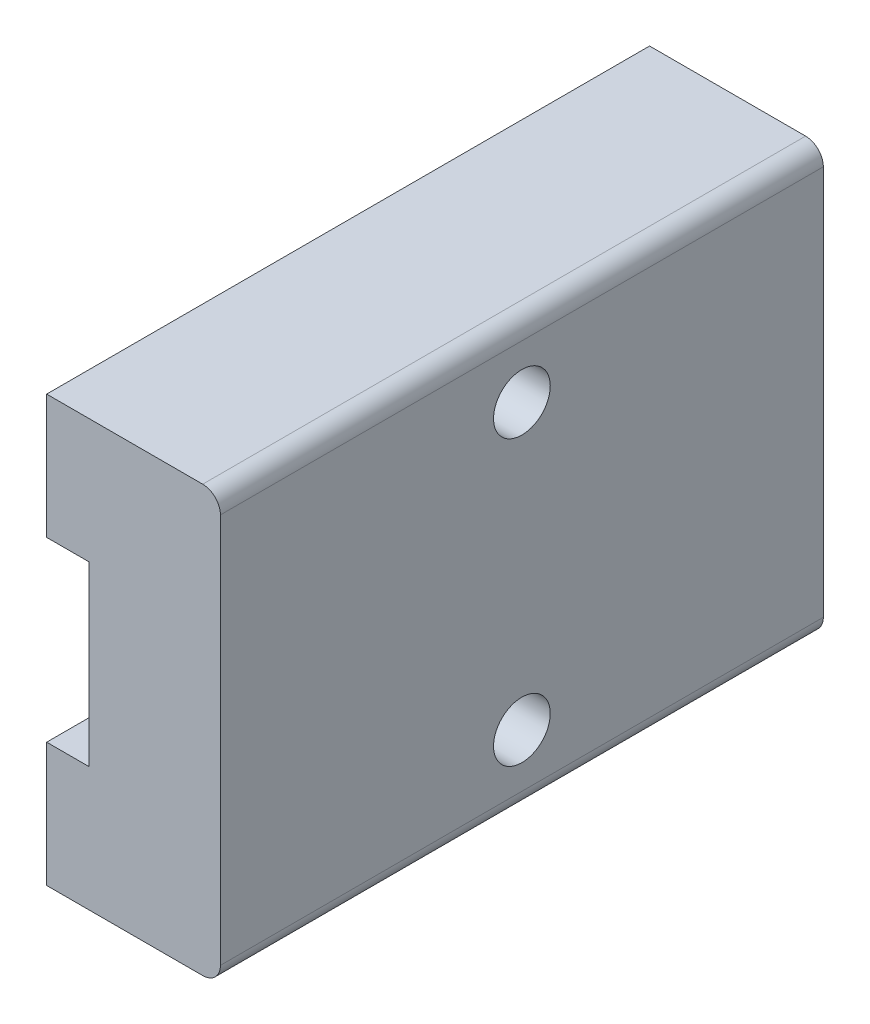
ISO-10303-21;
HEADER;
FILE_DESCRIPTION(('STEP AP214'),'2;1');
FILE_NAME('part.step','',(''),(''),'','','');
FILE_SCHEMA(('AUTOMOTIVE_DESIGN { 1 0 10303 214 1 1 1 1 }'));
ENDSEC;
DATA;
#1=APPLICATION_CONTEXT('core data for automotive mechanical design processes');
#2=APPLICATION_PROTOCOL_DEFINITION('international standard','automotive_design',2000,#1);
#3=PRODUCT_CONTEXT('',#1,'mechanical');
#4=PRODUCT('Part','Part','',(#3));
#5=PRODUCT_RELATED_PRODUCT_CATEGORY('part','',(#4));
#6=PRODUCT_DEFINITION_FORMATION('','',#4);
#7=PRODUCT_DEFINITION_CONTEXT('part definition',#1,'design');
#8=PRODUCT_DEFINITION('design','',#6,#7);
#9=PRODUCT_DEFINITION_SHAPE('','',#8);
#10=(LENGTH_UNIT() NAMED_UNIT(*) SI_UNIT(.MILLI.,.METRE.));
#11=(NAMED_UNIT(*) PLANE_ANGLE_UNIT() SI_UNIT($,.RADIAN.));
#12=(NAMED_UNIT(*) SI_UNIT($,.STERADIAN.) SOLID_ANGLE_UNIT());
#13=UNCERTAINTY_MEASURE_WITH_UNIT(LENGTH_MEASURE(1.E-05),#10,'distance_accuracy_value','');
#14=(GEOMETRIC_REPRESENTATION_CONTEXT(3) GLOBAL_UNCERTAINTY_ASSIGNED_CONTEXT((#13)) GLOBAL_UNIT_ASSIGNED_CONTEXT((#10,
#11,#12)) REPRESENTATION_CONTEXT('',''));
#15=CARTESIAN_POINT('',(0.,0.,0.));
#16=DIRECTION('',(0.,0.,1.));
#17=DIRECTION('',(1.,0.,0.));
#18=AXIS2_PLACEMENT_3D('',#15,#16,#17);
#19=CARTESIAN_POINT('',(-2.45,-6.,17.));
#20=DIRECTION('',(1.,0.,0.));
#21=DIRECTION('',(0.,0.,-1.));
#22=AXIS2_PLACEMENT_3D('',#19,#20,#21);
#23=PLANE('',#22);
#24=DIRECTION('',(0.,-1.,0.));
#25=VECTOR('',#24,1.);
#26=CARTESIAN_POINT('',(-2.45,-6.,0.));
#27=LINE('',#26,#25);
#28=CARTESIAN_POINT('',(-2.45,6.,0.));
#29=VERTEX_POINT('',#28);
#30=CARTESIAN_POINT('',(-2.45,2.5,0.));
#31=VERTEX_POINT('',#30);
#32=EDGE_CURVE('E203',#29,#31,#27,.T.);
#33=ORIENTED_EDGE('',*,*,#32,.T.);
#34=DIRECTION('',(0.,0.,1.));
#35=VECTOR('',#34,1.);
#36=CARTESIAN_POINT('',(-2.45,2.5,0.));
#37=LINE('',#36,#35);
#38=CARTESIAN_POINT('',(-2.45,2.5,17.));
#39=VERTEX_POINT('',#38);
#40=EDGE_CURVE('E175',#31,#39,#37,.T.);
#41=ORIENTED_EDGE('',*,*,#40,.T.);
#42=DIRECTION('',(0.,-1.,0.));
#43=VECTOR('',#42,1.);
#44=CARTESIAN_POINT('',(-2.45,-6.,17.));
#45=LINE('',#44,#43);
#46=CARTESIAN_POINT('',(-2.45,6.,17.));
#47=VERTEX_POINT('',#46);
#48=EDGE_CURVE('E188',#47,#39,#45,.T.);
#49=ORIENTED_EDGE('',*,*,#48,.F.);
#50=DIRECTION('',(0.,0.,-1.));
#51=VECTOR('',#50,1.);
#52=CARTESIAN_POINT('',(-2.45,6.,17.));
#53=LINE('',#52,#51);
#54=EDGE_CURVE('E202',#47,#29,#53,.T.);
#55=ORIENTED_EDGE('',*,*,#54,.T.);
#56=EDGE_LOOP('',(#33,#41,#49,#55));
#57=FACE_BOUND('',#56,.T.);
#58=ADVANCED_FACE('F42',(#57),#23,.F.);
#59=CARTESIAN_POINT('',(-2.45,-2.5,17.));
#60=VERTEX_POINT('',#59);
#61=CARTESIAN_POINT('',(-2.45,-6.,17.));
#62=VERTEX_POINT('',#61);
#63=EDGE_CURVE('E193',#60,#62,#45,.T.);
#64=ORIENTED_EDGE('',*,*,#63,.F.);
#65=DIRECTION('',(0.,0.,1.));
#66=VECTOR('',#65,1.);
#67=CARTESIAN_POINT('',(-2.45,-2.5,0.));
#68=LINE('',#67,#66);
#69=CARTESIAN_POINT('',(-2.45,-2.5,0.));
#70=VERTEX_POINT('',#69);
#71=EDGE_CURVE('E165',#70,#60,#68,.T.);
#72=ORIENTED_EDGE('',*,*,#71,.F.);
#73=CARTESIAN_POINT('',(-2.45,-6.,0.));
#74=VERTEX_POINT('',#73);
#75=EDGE_CURVE('E179',#70,#74,#27,.T.);
#76=ORIENTED_EDGE('',*,*,#75,.T.);
#77=DIRECTION('',(0.,0.,-1.));
#78=VECTOR('',#77,1.);
#79=CARTESIAN_POINT('',(-2.45,-6.,17.));
#80=LINE('',#79,#78);
#81=EDGE_CURVE('E219',#62,#74,#80,.T.);
#82=ORIENTED_EDGE('',*,*,#81,.F.);
#83=EDGE_LOOP('',(#64,#72,#76,#82));
#84=FACE_BOUND('',#83,.T.);
#85=ADVANCED_FACE('F268',(#84),#23,.F.);
#86=CARTESIAN_POINT('',(2.45,-6.,17.));
#87=DIRECTION('',(0.,1.,0.));
#88=DIRECTION('',(0.,0.,1.));
#89=AXIS2_PLACEMENT_3D('',#86,#87,#88);
#90=PLANE('',#89);
#91=DIRECTION('',(1.,0.,0.));
#92=VECTOR('',#91,1.);
#93=CARTESIAN_POINT('',(2.45,-6.,0.));
#94=LINE('',#93,#92);
#95=CARTESIAN_POINT('',(1.95,-6.,0.));
#96=VERTEX_POINT('',#95);
#97=EDGE_CURVE('E207',#74,#96,#94,.T.);
#98=ORIENTED_EDGE('',*,*,#97,.T.);
#99=DIRECTION('',(0.,0.,-1.));
#100=VECTOR('',#99,1.);
#101=CARTESIAN_POINT('',(1.95,-6.,17.));
#102=LINE('',#101,#100);
#103=CARTESIAN_POINT('',(1.95,-6.,17.));
#104=VERTEX_POINT('',#103);
#105=EDGE_CURVE('E11',#96,#104,#102,.F.);
#106=ORIENTED_EDGE('',*,*,#105,.T.);
#107=DIRECTION('',(1.,0.,0.));
#108=VECTOR('',#107,1.);
#109=CARTESIAN_POINT('',(2.45,-6.,17.));
#110=LINE('',#109,#108);
#111=EDGE_CURVE('E192',#62,#104,#110,.T.);
#112=ORIENTED_EDGE('',*,*,#111,.F.);
#113=ORIENTED_EDGE('',*,*,#81,.T.);
#114=EDGE_LOOP('',(#98,#106,#112,#113));
#115=FACE_BOUND('',#114,.T.);
#116=ADVANCED_FACE('F264',(#115),#90,.F.);
#117=CARTESIAN_POINT('',(2.45,-6.,17.));
#118=DIRECTION('',(-1.,0.,0.));
#119=DIRECTION('',(0.,0.,1.));
#120=AXIS2_PLACEMENT_3D('',#117,#118,#119);
#121=PLANE('',#120);
#122=CARTESIAN_POINT('',(2.45,4.,8.5));
#123=DIRECTION('',(1.,0.,0.));
#124=DIRECTION('',(0.,0.,-1.));
#125=AXIS2_PLACEMENT_3D('',#122,#123,#124);
#126=CIRCLE('',#125,0.799999999999999);
#127=CARTESIAN_POINT('',(2.45,4.,7.7));
#128=VERTEX_POINT('',#127);
#129=EDGE_CURVE('E138',#128,#128,#126,.T.);
#130=ORIENTED_EDGE('',*,*,#129,.F.);
#131=EDGE_LOOP('',(#130));
#132=FACE_BOUND('',#131,.T.);
#133=CARTESIAN_POINT('',(2.45,-4.,8.5));
#134=DIRECTION('',(1.,0.,0.));
#135=DIRECTION('',(0.,0.,-1.));
#136=AXIS2_PLACEMENT_3D('',#133,#134,#135);
#137=CIRCLE('',#136,0.799999999999999);
#138=CARTESIAN_POINT('',(2.45,-4.,7.7));
#139=VERTEX_POINT('',#138);
#140=EDGE_CURVE('E137',#139,#139,#137,.T.);
#141=ORIENTED_EDGE('',*,*,#140,.F.);
#142=EDGE_LOOP('',(#141));
#143=FACE_BOUND('',#142,.T.);
#144=DIRECTION('',(0.,1.,0.));
#145=VECTOR('',#144,1.);
#146=CARTESIAN_POINT('',(2.45,-6.,0.));
#147=LINE('',#146,#145);
#148=CARTESIAN_POINT('',(2.45,-5.5,0.));
#149=VERTEX_POINT('',#148);
#150=CARTESIAN_POINT('',(2.45,5.5,0.));
#151=VERTEX_POINT('',#150);
#152=EDGE_CURVE('E210',#149,#151,#147,.T.);
#153=ORIENTED_EDGE('',*,*,#152,.T.);
#154=DIRECTION('',(0.,0.,-1.));
#155=VECTOR('',#154,1.);
#156=CARTESIAN_POINT('',(2.45,5.5,17.));
#157=LINE('',#156,#155);
#158=CARTESIAN_POINT('',(2.45,5.5,17.));
#159=VERTEX_POINT('',#158);
#160=EDGE_CURVE('E64',#151,#159,#157,.F.);
#161=ORIENTED_EDGE('',*,*,#160,.T.);
#162=DIRECTION('',(0.,1.,0.));
#163=VECTOR('',#162,1.);
#164=CARTESIAN_POINT('',(2.45,-6.,17.));
#165=LINE('',#164,#163);
#166=CARTESIAN_POINT('',(2.45,-5.5,17.));
#167=VERTEX_POINT('',#166);
#168=EDGE_CURVE('E196',#167,#159,#165,.T.);
#169=ORIENTED_EDGE('',*,*,#168,.F.);
#170=DIRECTION('',(0.,0.,-1.));
#171=VECTOR('',#170,1.);
#172=CARTESIAN_POINT('',(2.45,-5.5,17.));
#173=LINE('',#172,#171);
#174=EDGE_CURVE('E233',#167,#149,#173,.T.);
#175=ORIENTED_EDGE('',*,*,#174,.T.);
#176=EDGE_LOOP('',(#153,#161,#169,#175));
#177=FACE_BOUND('',#176,.T.);
#178=ADVANCED_FACE('F258',(#132,#143,#177),#121,.F.);
#179=CARTESIAN_POINT('',(2.45,6.,17.));
#180=DIRECTION('',(0.,-1.,0.));
#181=DIRECTION('',(1.,0.,0.));
#182=AXIS2_PLACEMENT_3D('',#179,#180,#181);
#183=PLANE('',#182);
#184=DIRECTION('',(-1.,0.,0.));
#185=VECTOR('',#184,1.);
#186=CARTESIAN_POINT('',(2.45,6.,17.));
#187=LINE('',#186,#185);
#188=CARTESIAN_POINT('',(1.95,6.,17.));
#189=VERTEX_POINT('',#188);
#190=EDGE_CURVE('E199',#189,#47,#187,.T.);
#191=ORIENTED_EDGE('',*,*,#190,.F.);
#192=DIRECTION('',(0.,0.,-1.));
#193=VECTOR('',#192,1.);
#194=CARTESIAN_POINT('',(1.95,6.,17.));
#195=LINE('',#194,#193);
#196=CARTESIAN_POINT('',(1.95,6.,0.));
#197=VERTEX_POINT('',#196);
#198=EDGE_CURVE('E223',#189,#197,#195,.T.);
#199=ORIENTED_EDGE('',*,*,#198,.T.);
#200=DIRECTION('',(-1.,0.,0.));
#201=VECTOR('',#200,1.);
#202=CARTESIAN_POINT('',(2.45,6.,0.));
#203=LINE('',#202,#201);
#204=EDGE_CURVE('E213',#197,#29,#203,.T.);
#205=ORIENTED_EDGE('',*,*,#204,.T.);
#206=ORIENTED_EDGE('',*,*,#54,.F.);
#207=EDGE_LOOP('',(#191,#199,#205,#206));
#208=FACE_BOUND('',#207,.T.);
#209=ADVANCED_FACE('F250',(#208),#183,.F.);
#210=CARTESIAN_POINT('',(0.,0.,17.));
#211=DIRECTION('',(0.,0.,1.));
#212=DIRECTION('',(1.,0.,0.));
#213=AXIS2_PLACEMENT_3D('',#210,#211,#212);
#214=PLANE('',#213);
#215=ORIENTED_EDGE('',*,*,#168,.T.);
#216=CARTESIAN_POINT('',(1.95,5.5,17.));
#217=DIRECTION('',(0.,0.,1.));
#218=DIRECTION('',(1.,0.,0.));
#219=AXIS2_PLACEMENT_3D('',#216,#217,#218);
#220=CIRCLE('',#219,0.5);
#221=EDGE_CURVE('E51',#159,#189,#220,.T.);
#222=ORIENTED_EDGE('',*,*,#221,.T.);
#223=ORIENTED_EDGE('',*,*,#190,.T.);
#224=ORIENTED_EDGE('',*,*,#48,.T.);
#225=DIRECTION('',(-1.,0.,0.));
#226=VECTOR('',#225,1.);
#227=CARTESIAN_POINT('',(-1.25,2.5,17.));
#228=LINE('',#227,#226);
#229=CARTESIAN_POINT('',(-1.25,2.5,17.));
#230=VERTEX_POINT('',#229);
#231=EDGE_CURVE('E157',#230,#39,#228,.T.);
#232=ORIENTED_EDGE('',*,*,#231,.F.);
#233=DIRECTION('',(0.,1.,0.));
#234=VECTOR('',#233,1.);
#235=CARTESIAN_POINT('',(-1.25,-2.5,17.));
#236=LINE('',#235,#234);
#237=CARTESIAN_POINT('',(-1.25,-2.5,17.));
#238=VERTEX_POINT('',#237);
#239=EDGE_CURVE('E169',#238,#230,#236,.T.);
#240=ORIENTED_EDGE('',*,*,#239,.F.);
#241=DIRECTION('',(1.,0.,0.));
#242=VECTOR('',#241,1.);
#243=CARTESIAN_POINT('',(-2.45,-2.5,17.));
#244=LINE('',#243,#242);
#245=EDGE_CURVE('E151',#60,#238,#244,.T.);
#246=ORIENTED_EDGE('',*,*,#245,.F.);
#247=ORIENTED_EDGE('',*,*,#63,.T.);
#248=ORIENTED_EDGE('',*,*,#111,.T.);
#249=CARTESIAN_POINT('',(1.95,-5.5,17.));
#250=DIRECTION('',(0.,0.,1.));
#251=DIRECTION('',(1.,0.,0.));
#252=AXIS2_PLACEMENT_3D('',#249,#250,#251);
#253=CIRCLE('',#252,0.5);
#254=EDGE_CURVE('E239',#104,#167,#253,.T.);
#255=ORIENTED_EDGE('',*,*,#254,.T.);
#256=EDGE_LOOP('',(#215,#222,#223,#224,#232,#240,#246,#247,#248,#255));
#257=FACE_BOUND('',#256,.T.);
#258=ADVANCED_FACE('F245',(#257),#214,.T.);
#259=CARTESIAN_POINT('',(0.,0.,0.));
#260=DIRECTION('',(0.,0.,1.));
#261=DIRECTION('',(1.,0.,0.));
#262=AXIS2_PLACEMENT_3D('',#259,#260,#261);
#263=PLANE('',#262);
#264=ORIENTED_EDGE('',*,*,#204,.F.);
#265=CARTESIAN_POINT('',(1.95,5.5,0.));
#266=DIRECTION('',(0.,0.,1.));
#267=DIRECTION('',(1.,0.,0.));
#268=AXIS2_PLACEMENT_3D('',#265,#266,#267);
#269=CIRCLE('',#268,0.5);
#270=EDGE_CURVE('E230',#197,#151,#269,.F.);
#271=ORIENTED_EDGE('',*,*,#270,.T.);
#272=ORIENTED_EDGE('',*,*,#152,.F.);
#273=CARTESIAN_POINT('',(1.95,-5.5,0.));
#274=DIRECTION('',(0.,0.,1.));
#275=DIRECTION('',(1.,0.,0.));
#276=AXIS2_PLACEMENT_3D('',#273,#274,#275);
#277=CIRCLE('',#276,0.5);
#278=EDGE_CURVE('E227',#149,#96,#277,.F.);
#279=ORIENTED_EDGE('',*,*,#278,.T.);
#280=ORIENTED_EDGE('',*,*,#97,.F.);
#281=ORIENTED_EDGE('',*,*,#75,.F.);
#282=DIRECTION('',(1.,0.,0.));
#283=VECTOR('',#282,1.);
#284=CARTESIAN_POINT('',(-2.45,-2.5,0.));
#285=LINE('',#284,#283);
#286=CARTESIAN_POINT('',(-1.25,-2.5,0.));
#287=VERTEX_POINT('',#286);
#288=EDGE_CURVE('E152',#70,#287,#285,.T.);
#289=ORIENTED_EDGE('',*,*,#288,.T.);
#290=DIRECTION('',(0.,1.,0.));
#291=VECTOR('',#290,1.);
#292=CARTESIAN_POINT('',(-1.25,-2.5,0.));
#293=LINE('',#292,#291);
#294=CARTESIAN_POINT('',(-1.25,2.5,0.));
#295=VERTEX_POINT('',#294);
#296=EDGE_CURVE('E156',#287,#295,#293,.T.);
#297=ORIENTED_EDGE('',*,*,#296,.T.);
#298=DIRECTION('',(-1.,0.,0.));
#299=VECTOR('',#298,1.);
#300=CARTESIAN_POINT('',(-1.25,2.5,0.));
#301=LINE('',#300,#299);
#302=EDGE_CURVE('E161',#295,#31,#301,.T.);
#303=ORIENTED_EDGE('',*,*,#302,.T.);
#304=ORIENTED_EDGE('',*,*,#32,.F.);
#305=EDGE_LOOP('',(#264,#271,#272,#279,#280,#281,#289,#297,#303,#304));
#306=FACE_BOUND('',#305,.T.);
#307=ADVANCED_FACE('F256',(#306),#263,.F.);
#308=CARTESIAN_POINT('',(-1.25,2.5,0.));
#309=DIRECTION('',(0.,1.,0.));
#310=DIRECTION('',(0.,0.,1.));
#311=AXIS2_PLACEMENT_3D('',#308,#309,#310);
#312=PLANE('',#311);
#313=ORIENTED_EDGE('',*,*,#231,.T.);
#314=ORIENTED_EDGE('',*,*,#40,.F.);
#315=ORIENTED_EDGE('',*,*,#302,.F.);
#316=DIRECTION('',(0.,0.,1.));
#317=VECTOR('',#316,1.);
#318=CARTESIAN_POINT('',(-1.25,2.5,0.));
#319=LINE('',#318,#317);
#320=EDGE_CURVE('E180',#295,#230,#319,.T.);
#321=ORIENTED_EDGE('',*,*,#320,.T.);
#322=EDGE_LOOP('',(#313,#314,#315,#321));
#323=FACE_BOUND('',#322,.T.);
#324=ADVANCED_FACE('F282',(#323),#312,.F.);
#325=CARTESIAN_POINT('',(-1.25,-2.5,0.));
#326=DIRECTION('',(1.,0.,0.));
#327=DIRECTION('',(0.,1.,0.));
#328=AXIS2_PLACEMENT_3D('',#325,#326,#327);
#329=PLANE('',#328);
#330=ORIENTED_EDGE('',*,*,#239,.T.);
#331=ORIENTED_EDGE('',*,*,#320,.F.);
#332=ORIENTED_EDGE('',*,*,#296,.F.);
#333=DIRECTION('',(0.,0.,1.));
#334=VECTOR('',#333,1.);
#335=CARTESIAN_POINT('',(-1.25,-2.5,0.));
#336=LINE('',#335,#334);
#337=EDGE_CURVE('E183',#287,#238,#336,.T.);
#338=ORIENTED_EDGE('',*,*,#337,.T.);
#339=EDGE_LOOP('',(#330,#331,#332,#338));
#340=FACE_BOUND('',#339,.T.);
#341=ADVANCED_FACE('F280',(#340),#329,.F.);
#342=CARTESIAN_POINT('',(-2.45,-2.5,0.));
#343=DIRECTION('',(0.,-1.,0.));
#344=DIRECTION('',(0.,0.,-1.));
#345=AXIS2_PLACEMENT_3D('',#342,#343,#344);
#346=PLANE('',#345);
#347=ORIENTED_EDGE('',*,*,#245,.T.);
#348=ORIENTED_EDGE('',*,*,#337,.F.);
#349=ORIENTED_EDGE('',*,*,#288,.F.);
#350=ORIENTED_EDGE('',*,*,#71,.T.);
#351=EDGE_LOOP('',(#347,#348,#349,#350));
#352=FACE_BOUND('',#351,.T.);
#353=ADVANCED_FACE('F277',(#352),#346,.F.);
#354=CARTESIAN_POINT('',(1.95,5.5,17.));
#355=DIRECTION('',(0.,0.,-1.));
#356=DIRECTION('',(-1.,0.,0.));
#357=AXIS2_PLACEMENT_3D('',#354,#355,#356);
#358=CYLINDRICAL_SURFACE('',#357,0.5);
#359=ORIENTED_EDGE('',*,*,#221,.F.);
#360=ORIENTED_EDGE('',*,*,#160,.F.);
#361=ORIENTED_EDGE('',*,*,#270,.F.);
#362=ORIENTED_EDGE('',*,*,#198,.F.);
#363=EDGE_LOOP('',(#359,#360,#361,#362));
#364=FACE_BOUND('',#363,.T.);
#365=ADVANCED_FACE('F253',(#364),#358,.T.);
#366=CARTESIAN_POINT('',(1.95,-5.5,17.));
#367=DIRECTION('',(0.,0.,-1.));
#368=DIRECTION('',(-1.,0.,0.));
#369=AXIS2_PLACEMENT_3D('',#366,#367,#368);
#370=CYLINDRICAL_SURFACE('',#369,0.5);
#371=ORIENTED_EDGE('',*,*,#254,.F.);
#372=ORIENTED_EDGE('',*,*,#105,.F.);
#373=ORIENTED_EDGE('',*,*,#278,.F.);
#374=ORIENTED_EDGE('',*,*,#174,.F.);
#375=EDGE_LOOP('',(#371,#372,#373,#374));
#376=FACE_BOUND('',#375,.T.);
#377=ADVANCED_FACE('F44',(#376),#370,.T.);
#378=CARTESIAN_POINT('',(0.25,-4.,8.5));
#379=DIRECTION('',(1.,0.,0.));
#380=DIRECTION('',(0.,0.,-1.));
#381=AXIS2_PLACEMENT_3D('',#378,#379,#380);
#382=CONICAL_SURFACE('',#381,0.799999999999999,1.02974425867665);
#383=CARTESIAN_POINT('',(-0.230688495222048,-4.,8.5));
#384=VERTEX_POINT('',#383);
#385=VERTEX_LOOP('',#384);
#386=FACE_BOUND('',#385,.T.);
#387=CARTESIAN_POINT('',(0.25,-4.,8.5));
#388=DIRECTION('',(1.,0.,0.));
#389=DIRECTION('',(0.,0.,-1.));
#390=AXIS2_PLACEMENT_3D('',#387,#388,#389);
#391=CIRCLE('',#390,0.799999999999999);
#392=CARTESIAN_POINT('',(0.25,-4.,7.7));
#393=VERTEX_POINT('',#392);
#394=EDGE_CURVE('E143',#393,#393,#391,.T.);
#395=ORIENTED_EDGE('',*,*,#394,.T.);
#396=EDGE_LOOP('',(#395));
#397=FACE_BOUND('',#396,.T.);
#398=ADVANCED_FACE('F296',(#386,#397),#382,.F.);
#399=CARTESIAN_POINT('',(2.45,-4.,8.5));
#400=DIRECTION('',(1.,0.,0.));
#401=DIRECTION('',(0.,0.,-1.));
#402=AXIS2_PLACEMENT_3D('',#399,#400,#401);
#403=CYLINDRICAL_SURFACE('',#402,0.799999999999999);
#404=ORIENTED_EDGE('',*,*,#394,.F.);
#405=EDGE_LOOP('',(#404));
#406=FACE_BOUND('',#405,.T.);
#407=ORIENTED_EDGE('',*,*,#140,.T.);
#408=EDGE_LOOP('',(#407));
#409=FACE_BOUND('',#408,.T.);
#410=ADVANCED_FACE('F130',(#406,#409),#403,.F.);
#411=CARTESIAN_POINT('',(0.25,4.,8.5));
#412=DIRECTION('',(1.,0.,0.));
#413=DIRECTION('',(0.,0.,-1.));
#414=AXIS2_PLACEMENT_3D('',#411,#412,#413);
#415=CONICAL_SURFACE('',#414,0.799999999999999,1.02974425867665);
#416=CARTESIAN_POINT('',(-0.230688495222048,4.,8.5));
#417=VERTEX_POINT('',#416);
#418=VERTEX_LOOP('',#417);
#419=FACE_BOUND('',#418,.T.);
#420=CARTESIAN_POINT('',(0.25,4.,8.5));
#421=DIRECTION('',(1.,0.,0.));
#422=DIRECTION('',(0.,0.,-1.));
#423=AXIS2_PLACEMENT_3D('',#420,#421,#422);
#424=CIRCLE('',#423,0.799999999999999);
#425=CARTESIAN_POINT('',(0.25,4.,7.7));
#426=VERTEX_POINT('',#425);
#427=EDGE_CURVE('E134',#426,#426,#424,.T.);
#428=ORIENTED_EDGE('',*,*,#427,.T.);
#429=EDGE_LOOP('',(#428));
#430=FACE_BOUND('',#429,.T.);
#431=ADVANCED_FACE('F126',(#419,#430),#415,.F.);
#432=CARTESIAN_POINT('',(2.45,4.,8.5));
#433=DIRECTION('',(1.,0.,0.));
#434=DIRECTION('',(0.,0.,-1.));
#435=AXIS2_PLACEMENT_3D('',#432,#433,#434);
#436=CYLINDRICAL_SURFACE('',#435,0.799999999999999);
#437=ORIENTED_EDGE('',*,*,#427,.F.);
#438=EDGE_LOOP('',(#437));
#439=FACE_BOUND('',#438,.T.);
#440=ORIENTED_EDGE('',*,*,#129,.T.);
#441=EDGE_LOOP('',(#440));
#442=FACE_BOUND('',#441,.T.);
#443=ADVANCED_FACE('F129',(#439,#442),#436,.F.);
#444=CLOSED_SHELL('',(#58,#85,#116,#178,#209,#258,#307,#324,#341,#353,#365,#377,#398,#410,#431,#443));
#445=MANIFOLD_SOLID_BREP('B2',#444);
#446=ADVANCED_BREP_SHAPE_REPRESENTATION('',(#18,#445),#14);
#447=SHAPE_DEFINITION_REPRESENTATION(#9,#446);
ENDSEC;
END-ISO-10303-21;
